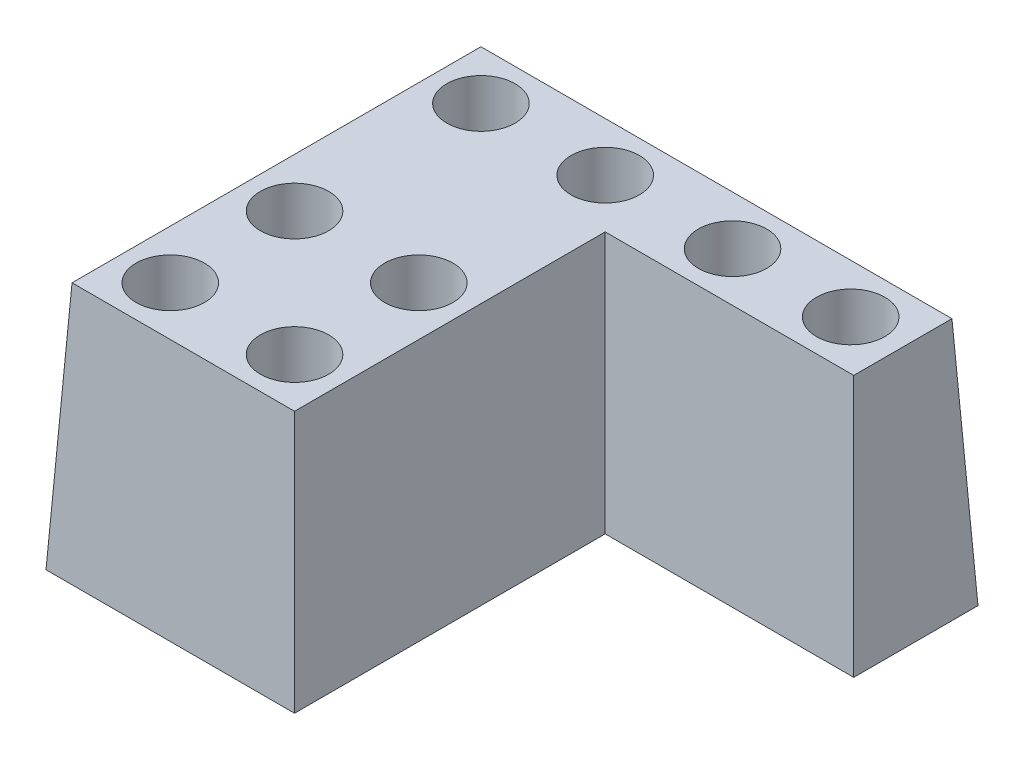
ISO-10303-21;
HEADER;
FILE_DESCRIPTION(('STEP AP214'),'2;1');
FILE_NAME('part.step','',(''),(''),'','','');
FILE_SCHEMA(('AUTOMOTIVE_DESIGN { 1 0 10303 214 1 1 1 1 }'));
ENDSEC;
DATA;
#1=APPLICATION_CONTEXT('core data for automotive mechanical design processes');
#2=APPLICATION_PROTOCOL_DEFINITION('international standard','automotive_design',2000,#1);
#3=PRODUCT_CONTEXT('',#1,'mechanical');
#4=PRODUCT('Part','Part','',(#3));
#5=PRODUCT_RELATED_PRODUCT_CATEGORY('part','',(#4));
#6=PRODUCT_DEFINITION_FORMATION('','',#4);
#7=PRODUCT_DEFINITION_CONTEXT('part definition',#1,'design');
#8=PRODUCT_DEFINITION('design','',#6,#7);
#9=PRODUCT_DEFINITION_SHAPE('','',#8);
#10=(LENGTH_UNIT() NAMED_UNIT(*) SI_UNIT(.MILLI.,.METRE.));
#11=(NAMED_UNIT(*) PLANE_ANGLE_UNIT() SI_UNIT($,.RADIAN.));
#12=(NAMED_UNIT(*) SI_UNIT($,.STERADIAN.) SOLID_ANGLE_UNIT());
#13=UNCERTAINTY_MEASURE_WITH_UNIT(LENGTH_MEASURE(1.E-05),#10,'distance_accuracy_value','');
#14=(GEOMETRIC_REPRESENTATION_CONTEXT(3) GLOBAL_UNCERTAINTY_ASSIGNED_CONTEXT((#13)) GLOBAL_UNIT_ASSIGNED_CONTEXT((#10,
#11,#12)) REPRESENTATION_CONTEXT('',''));
#15=CARTESIAN_POINT('',(0.,0.,0.));
#16=DIRECTION('',(0.,0.,1.));
#17=DIRECTION('',(1.,0.,0.));
#18=AXIS2_PLACEMENT_3D('',#15,#16,#17);
#19=CARTESIAN_POINT('',(0.,0.,0.));
#20=DIRECTION('',(-0.998629534754574,0.0523359562429439,0.));
#21=DIRECTION('',(-0.0523359562429439,-0.998629534754574,0.));
#22=AXIS2_PLACEMENT_3D('',#19,#20,#21);
#23=PLANE('',#22);
#24=DIRECTION('',(0.,0.,1.));
#25=VECTOR('',#24,1.);
#26=CARTESIAN_POINT('',(0.,0.,0.));
#27=LINE('',#26,#25);
#28=CARTESIAN_POINT('',(0.,0.,-70.));
#29=VERTEX_POINT('',#28);
#30=CARTESIAN_POINT('',(0.,0.,0.));
#31=VERTEX_POINT('',#30);
#32=EDGE_CURVE('E92',#29,#31,#27,.T.);
#33=ORIENTED_EDGE('',*,*,#32,.T.);
#34=DIRECTION('',(-0.052264427688714,-0.997264688634237,0.052264427688714));
#35=VECTOR('',#34,1.);
#36=CARTESIAN_POINT('',(0.,0.,0.));
#37=LINE('',#36,#35);
#38=CARTESIAN_POINT('',(2.09631117132165,40.,-2.09631117132165));
#39=VERTEX_POINT('',#38);
#40=EDGE_CURVE('E11',#39,#31,#37,.T.);
#41=ORIENTED_EDGE('',*,*,#40,.F.);
#42=DIRECTION('',(0.,0.,-1.));
#43=VECTOR('',#42,1.);
#44=CARTESIAN_POINT('',(2.09631117132165,40.,0.));
#45=LINE('',#44,#43);
#46=CARTESIAN_POINT('',(2.09631117132165,40.,-67.9036888286784));
#47=VERTEX_POINT('',#46);
#48=EDGE_CURVE('E118',#47,#39,#45,.F.);
#49=ORIENTED_EDGE('',*,*,#48,.F.);
#50=DIRECTION('',(-0.052264427688714,-0.997264688634237,-0.052264427688714));
#51=VECTOR('',#50,1.);
#52=CARTESIAN_POINT('',(0.191209928114017,3.64850277439424,-69.808790071886));
#53=LINE('',#52,#51);
#54=EDGE_CURVE('E104',#47,#29,#53,.T.);
#55=ORIENTED_EDGE('',*,*,#54,.T.);
#56=EDGE_LOOP('',(#33,#41,#49,#55));
#57=FACE_BOUND('',#56,.T.);
#58=ADVANCED_FACE('F34',(#57),#23,.T.);
#59=CARTESIAN_POINT('',(0.,0.,0.));
#60=DIRECTION('',(0.,0.0523359562429439,0.998629534754574));
#61=DIRECTION('',(0.,-0.998629534754574,0.0523359562429439));
#62=AXIS2_PLACEMENT_3D('',#59,#60,#61);
#63=PLANE('',#62);
#64=DIRECTION('',(1.,0.,0.));
#65=VECTOR('',#64,1.);
#66=CARTESIAN_POINT('',(0.,0.,0.));
#67=LINE('',#66,#65);
#68=CARTESIAN_POINT('',(40.,0.,0.));
#69=VERTEX_POINT('',#68);
#70=EDGE_CURVE('E88',#31,#69,#67,.T.);
#71=ORIENTED_EDGE('',*,*,#70,.T.);
#72=DIRECTION('',(0.052264427688714,-0.997264688634237,0.052264427688714));
#73=VECTOR('',#72,1.);
#74=CARTESIAN_POINT('',(40.,0.,0.));
#75=LINE('',#74,#73);
#76=CARTESIAN_POINT('',(37.9036888286784,40.,-2.09631117132165));
#77=VERTEX_POINT('',#76);
#78=EDGE_CURVE('E43',#77,#69,#75,.T.);
#79=ORIENTED_EDGE('',*,*,#78,.F.);
#80=DIRECTION('',(-1.,0.,0.));
#81=VECTOR('',#80,1.);
#82=CARTESIAN_POINT('',(0.,40.,-2.09631117132165));
#83=LINE('',#82,#81);
#84=EDGE_CURVE('E100',#39,#77,#83,.F.);
#85=ORIENTED_EDGE('',*,*,#84,.F.);
#86=ORIENTED_EDGE('',*,*,#40,.T.);
#87=EDGE_LOOP('',(#71,#79,#85,#86));
#88=FACE_BOUND('',#87,.T.);
#89=ADVANCED_FACE('F36',(#88),#63,.T.);
#90=CARTESIAN_POINT('',(40.,0.,0.));
#91=DIRECTION('',(0.998629534754574,0.0523359562429439,0.));
#92=DIRECTION('',(-0.0523359562429439,0.998629534754574,0.));
#93=AXIS2_PLACEMENT_3D('',#90,#91,#92);
#94=PLANE('',#93);
#95=DIRECTION('',(0.,0.,-1.));
#96=VECTOR('',#95,1.);
#97=CARTESIAN_POINT('',(40.,0.,0.));
#98=LINE('',#97,#96);
#99=CARTESIAN_POINT('',(40.,0.,-50.));
#100=VERTEX_POINT('',#99);
#101=EDGE_CURVE('E94',#69,#100,#98,.T.);
#102=ORIENTED_EDGE('',*,*,#101,.T.);
#103=DIRECTION('',(0.052264427688714,-0.997264688634237,0.052264427688714));
#104=VECTOR('',#103,1.);
#105=CARTESIAN_POINT('',(40.1365785200814,-2.6060734102816,-49.8634214799186));
#106=LINE('',#105,#104);
#107=CARTESIAN_POINT('',(37.9036888286784,40.,-52.0963111713216));
#108=VERTEX_POINT('',#107);
#109=EDGE_CURVE('E127',#108,#100,#106,.T.);
#110=ORIENTED_EDGE('',*,*,#109,.F.);
#111=DIRECTION('',(0.,0.,1.));
#112=VECTOR('',#111,1.);
#113=CARTESIAN_POINT('',(37.9036888286783,40.,0.));
#114=LINE('',#113,#112);
#115=EDGE_CURVE('E133',#77,#108,#114,.F.);
#116=ORIENTED_EDGE('',*,*,#115,.F.);
#117=ORIENTED_EDGE('',*,*,#78,.T.);
#118=EDGE_LOOP('',(#102,#110,#116,#117));
#119=FACE_BOUND('',#118,.T.);
#120=ADVANCED_FACE('F149',(#119),#94,.T.);
#121=CARTESIAN_POINT('',(80.,0.,-50.));
#122=DIRECTION('',(0.,0.0523359562429439,0.998629534754574));
#123=DIRECTION('',(0.,-0.998629534754574,0.0523359562429439));
#124=AXIS2_PLACEMENT_3D('',#121,#122,#123);
#125=PLANE('',#124);
#126=DIRECTION('',(1.,0.,0.));
#127=VECTOR('',#126,1.);
#128=CARTESIAN_POINT('',(80.,0.,-50.));
#129=LINE('',#128,#127);
#130=CARTESIAN_POINT('',(80.,0.,-50.));
#131=VERTEX_POINT('',#130);
#132=EDGE_CURVE('E113',#100,#131,#129,.T.);
#133=ORIENTED_EDGE('',*,*,#132,.T.);
#134=DIRECTION('',(0.052264427688714,-0.997264688634237,0.052264427688714));
#135=VECTOR('',#134,1.);
#136=CARTESIAN_POINT('',(80.,0.,-50.));
#137=LINE('',#136,#135);
#138=CARTESIAN_POINT('',(77.9036888286783,40.,-52.0963111713216));
#139=VERTEX_POINT('',#138);
#140=EDGE_CURVE('E124',#139,#131,#137,.T.);
#141=ORIENTED_EDGE('',*,*,#140,.F.);
#142=DIRECTION('',(-1.,0.,0.));
#143=VECTOR('',#142,1.);
#144=CARTESIAN_POINT('',(0.,40.,-52.0963111713216));
#145=LINE('',#144,#143);
#146=EDGE_CURVE('E135',#108,#139,#145,.F.);
#147=ORIENTED_EDGE('',*,*,#146,.F.);
#148=ORIENTED_EDGE('',*,*,#109,.T.);
#149=EDGE_LOOP('',(#133,#141,#147,#148));
#150=FACE_BOUND('',#149,.T.);
#151=ADVANCED_FACE('F142',(#150),#125,.T.);
#152=CARTESIAN_POINT('',(80.,0.,-50.));
#153=DIRECTION('',(0.998629534754574,0.0523359562429439,0.));
#154=DIRECTION('',(-0.0523359562429439,0.998629534754574,0.));
#155=AXIS2_PLACEMENT_3D('',#152,#153,#154);
#156=PLANE('',#155);
#157=DIRECTION('',(0.,0.,-1.));
#158=VECTOR('',#157,1.);
#159=CARTESIAN_POINT('',(80.,0.,-50.));
#160=LINE('',#159,#158);
#161=CARTESIAN_POINT('',(80.,0.,-70.));
#162=VERTEX_POINT('',#161);
#163=EDGE_CURVE('E115',#131,#162,#160,.T.);
#164=ORIENTED_EDGE('',*,*,#163,.T.);
#165=DIRECTION('',(0.052264427688714,-0.997264688634237,-0.052264427688714));
#166=VECTOR('',#165,1.);
#167=CARTESIAN_POINT('',(79.7814743678697,4.16971745645056,-69.7814743678697));
#168=LINE('',#167,#166);
#169=CARTESIAN_POINT('',(77.9036888286783,40.,-67.9036888286784));
#170=VERTEX_POINT('',#169);
#171=EDGE_CURVE('E121',#170,#162,#168,.T.);
#172=ORIENTED_EDGE('',*,*,#171,.F.);
#173=DIRECTION('',(0.,0.,1.));
#174=VECTOR('',#173,1.);
#175=CARTESIAN_POINT('',(77.9036888286783,40.,0.));
#176=LINE('',#175,#174);
#177=EDGE_CURVE('E55',#139,#170,#176,.F.);
#178=ORIENTED_EDGE('',*,*,#177,.F.);
#179=ORIENTED_EDGE('',*,*,#140,.T.);
#180=EDGE_LOOP('',(#164,#172,#178,#179));
#181=FACE_BOUND('',#180,.T.);
#182=ADVANCED_FACE('F145',(#181),#156,.T.);
#183=CARTESIAN_POINT('',(0.,0.,-70.));
#184=DIRECTION('',(0.,0.0523359562429439,-0.998629534754574));
#185=DIRECTION('',(0.,0.998629534754574,0.0523359562429439));
#186=AXIS2_PLACEMENT_3D('',#183,#184,#185);
#187=PLANE('',#186);
#188=DIRECTION('',(-1.,0.,0.));
#189=VECTOR('',#188,1.);
#190=CARTESIAN_POINT('',(0.,0.,-70.));
#191=LINE('',#190,#189);
#192=EDGE_CURVE('E117',#162,#29,#191,.T.);
#193=ORIENTED_EDGE('',*,*,#192,.T.);
#194=ORIENTED_EDGE('',*,*,#54,.F.);
#195=DIRECTION('',(1.,0.,0.));
#196=VECTOR('',#195,1.);
#197=CARTESIAN_POINT('',(0.,40.,-67.9036888286784));
#198=LINE('',#197,#196);
#199=EDGE_CURVE('E38',#170,#47,#198,.F.);
#200=ORIENTED_EDGE('',*,*,#199,.F.);
#201=ORIENTED_EDGE('',*,*,#171,.T.);
#202=EDGE_LOOP('',(#193,#194,#200,#201));
#203=FACE_BOUND('',#202,.T.);
#204=ADVANCED_FACE('F147',(#203),#187,.T.);
#205=CARTESIAN_POINT('',(0.,40.,0.));
#206=DIRECTION('',(0.,-1.,0.));
#207=DIRECTION('',(0.,0.,-1.));
#208=AXIS2_PLACEMENT_3D('',#205,#206,#207);
#209=PLANE('',#208);
#210=CARTESIAN_POINT('',(69.5081967213115,40.,-60.));
#211=DIRECTION('',(0.,1.,0.));
#212=DIRECTION('',(0.,0.,1.));
#213=AXIS2_PLACEMENT_3D('',#210,#211,#212);
#214=CIRCLE('',#213,5.49999999999999);
#215=CARTESIAN_POINT('',(69.5081967213115,40.,-54.5));
#216=VERTEX_POINT('',#215);
#217=EDGE_CURVE('E460',#216,#216,#214,.T.);
#218=ORIENTED_EDGE('',*,*,#217,.F.);
#219=EDGE_LOOP('',(#218));
#220=FACE_BOUND('',#219,.T.);
#221=CARTESIAN_POINT('',(30.,40.,-9.99999999999999));
#222=DIRECTION('',(0.,1.,0.));
#223=DIRECTION('',(0.,0.,1.));
#224=AXIS2_PLACEMENT_3D('',#221,#222,#223);
#225=CIRCLE('',#224,5.49999999999999);
#226=CARTESIAN_POINT('',(30.,40.,-4.5));
#227=VERTEX_POINT('',#226);
#228=EDGE_CURVE('E470',#227,#227,#225,.T.);
#229=ORIENTED_EDGE('',*,*,#228,.F.);
#230=EDGE_LOOP('',(#229));
#231=FACE_BOUND('',#230,.T.);
#232=CARTESIAN_POINT('',(10.,40.,-9.99999999999999));
#233=DIRECTION('',(0.,1.,0.));
#234=DIRECTION('',(0.,0.,1.));
#235=AXIS2_PLACEMENT_3D('',#232,#233,#234);
#236=CIRCLE('',#235,5.49999999999999);
#237=CARTESIAN_POINT('',(10.,40.,-4.5));
#238=VERTEX_POINT('',#237);
#239=EDGE_CURVE('E482',#238,#238,#236,.T.);
#240=ORIENTED_EDGE('',*,*,#239,.F.);
#241=EDGE_LOOP('',(#240));
#242=FACE_BOUND('',#241,.T.);
#243=CARTESIAN_POINT('',(10.,40.,-60.));
#244=DIRECTION('',(0.,1.,0.));
#245=DIRECTION('',(0.,0.,1.));
#246=AXIS2_PLACEMENT_3D('',#243,#244,#245);
#247=CIRCLE('',#246,5.49999999999999);
#248=CARTESIAN_POINT('',(10.,40.,-54.5));
#249=VERTEX_POINT('',#248);
#250=EDGE_CURVE('E494',#249,#249,#247,.T.);
#251=ORIENTED_EDGE('',*,*,#250,.F.);
#252=EDGE_LOOP('',(#251));
#253=FACE_BOUND('',#252,.T.);
#254=CARTESIAN_POINT('',(50.4918032786886,40.,-60.));
#255=DIRECTION('',(0.,1.,0.));
#256=DIRECTION('',(0.,0.,1.));
#257=AXIS2_PLACEMENT_3D('',#254,#255,#256);
#258=CIRCLE('',#257,5.5);
#259=CARTESIAN_POINT('',(50.4918032786886,40.,-54.5));
#260=VERTEX_POINT('',#259);
#261=EDGE_CURVE('E506',#260,#260,#258,.T.);
#262=ORIENTED_EDGE('',*,*,#261,.F.);
#263=EDGE_LOOP('',(#262));
#264=FACE_BOUND('',#263,.T.);
#265=CARTESIAN_POINT('',(30.,40.,-60.));
#266=DIRECTION('',(0.,1.,0.));
#267=DIRECTION('',(0.,0.,1.));
#268=AXIS2_PLACEMENT_3D('',#265,#266,#267);
#269=CIRCLE('',#268,5.5);
#270=CARTESIAN_POINT('',(30.,40.,-54.5));
#271=VERTEX_POINT('',#270);
#272=EDGE_CURVE('E518',#271,#271,#269,.T.);
#273=ORIENTED_EDGE('',*,*,#272,.F.);
#274=EDGE_LOOP('',(#273));
#275=FACE_BOUND('',#274,.T.);
#276=CARTESIAN_POINT('',(10.,40.,-30.));
#277=DIRECTION('',(0.,1.,0.));
#278=DIRECTION('',(0.,0.,1.));
#279=AXIS2_PLACEMENT_3D('',#276,#277,#278);
#280=CIRCLE('',#279,5.5);
#281=CARTESIAN_POINT('',(10.,40.,-24.5));
#282=VERTEX_POINT('',#281);
#283=EDGE_CURVE('E530',#282,#282,#280,.T.);
#284=ORIENTED_EDGE('',*,*,#283,.F.);
#285=EDGE_LOOP('',(#284));
#286=FACE_BOUND('',#285,.T.);
#287=CARTESIAN_POINT('',(30.,40.,-30.));
#288=DIRECTION('',(0.,1.,0.));
#289=DIRECTION('',(0.,0.,1.));
#290=AXIS2_PLACEMENT_3D('',#287,#288,#289);
#291=CIRCLE('',#290,5.5);
#292=CARTESIAN_POINT('',(30.,40.,-24.5));
#293=VERTEX_POINT('',#292);
#294=EDGE_CURVE('E542',#293,#293,#291,.T.);
#295=ORIENTED_EDGE('',*,*,#294,.F.);
#296=EDGE_LOOP('',(#295));
#297=FACE_BOUND('',#296,.T.);
#298=ORIENTED_EDGE('',*,*,#48,.T.);
#299=ORIENTED_EDGE('',*,*,#84,.T.);
#300=ORIENTED_EDGE('',*,*,#115,.T.);
#301=ORIENTED_EDGE('',*,*,#146,.T.);
#302=ORIENTED_EDGE('',*,*,#177,.T.);
#303=ORIENTED_EDGE('',*,*,#199,.T.);
#304=EDGE_LOOP('',(#298,#299,#300,#301,#302,#303));
#305=FACE_BOUND('',#304,.T.);
#306=ADVANCED_FACE('F138',(#220,#231,#242,#253,#264,#275,#286,#297,#305),#209,.F.);
#307=CARTESIAN_POINT('',(0.,0.,0.));
#308=DIRECTION('',(0.,-1.,0.));
#309=DIRECTION('',(0.,0.,-1.));
#310=AXIS2_PLACEMENT_3D('',#307,#308,#309);
#311=PLANE('',#310);
#312=CARTESIAN_POINT('',(69.5081967213115,0.,-60.));
#313=DIRECTION('',(0.,1.,0.));
#314=DIRECTION('',(0.,0.,1.));
#315=AXIS2_PLACEMENT_3D('',#312,#313,#314);
#316=CIRCLE('',#315,2.74999999999999);
#317=CARTESIAN_POINT('',(69.5081967213115,0.,-57.25));
#318=VERTEX_POINT('',#317);
#319=EDGE_CURVE('E467',#318,#318,#316,.T.);
#320=ORIENTED_EDGE('',*,*,#319,.T.);
#321=EDGE_LOOP('',(#320));
#322=FACE_BOUND('',#321,.T.);
#323=CARTESIAN_POINT('',(30.,0.,-9.99999999999999));
#324=DIRECTION('',(0.,1.,0.));
#325=DIRECTION('',(0.,0.,1.));
#326=AXIS2_PLACEMENT_3D('',#323,#324,#325);
#327=CIRCLE('',#326,2.74999999999999);
#328=CARTESIAN_POINT('',(30.,0.,-7.25));
#329=VERTEX_POINT('',#328);
#330=EDGE_CURVE('E479',#329,#329,#327,.T.);
#331=ORIENTED_EDGE('',*,*,#330,.T.);
#332=EDGE_LOOP('',(#331));
#333=FACE_BOUND('',#332,.T.);
#334=CARTESIAN_POINT('',(10.,0.,-9.99999999999999));
#335=DIRECTION('',(0.,1.,0.));
#336=DIRECTION('',(0.,0.,1.));
#337=AXIS2_PLACEMENT_3D('',#334,#335,#336);
#338=CIRCLE('',#337,2.74999999999999);
#339=CARTESIAN_POINT('',(10.,0.,-7.25));
#340=VERTEX_POINT('',#339);
#341=EDGE_CURVE('E491',#340,#340,#338,.T.);
#342=ORIENTED_EDGE('',*,*,#341,.T.);
#343=EDGE_LOOP('',(#342));
#344=FACE_BOUND('',#343,.T.);
#345=CARTESIAN_POINT('',(10.,0.,-60.));
#346=DIRECTION('',(0.,1.,0.));
#347=DIRECTION('',(0.,0.,1.));
#348=AXIS2_PLACEMENT_3D('',#345,#346,#347);
#349=CIRCLE('',#348,2.74999999999999);
#350=CARTESIAN_POINT('',(10.,0.,-57.25));
#351=VERTEX_POINT('',#350);
#352=EDGE_CURVE('E503',#351,#351,#349,.T.);
#353=ORIENTED_EDGE('',*,*,#352,.T.);
#354=EDGE_LOOP('',(#353));
#355=FACE_BOUND('',#354,.T.);
#356=CARTESIAN_POINT('',(50.4918032786886,0.,-60.));
#357=DIRECTION('',(0.,1.,0.));
#358=DIRECTION('',(0.,0.,1.));
#359=AXIS2_PLACEMENT_3D('',#356,#357,#358);
#360=CIRCLE('',#359,2.74999999999999);
#361=CARTESIAN_POINT('',(50.4918032786886,0.,-57.25));
#362=VERTEX_POINT('',#361);
#363=EDGE_CURVE('E515',#362,#362,#360,.T.);
#364=ORIENTED_EDGE('',*,*,#363,.T.);
#365=EDGE_LOOP('',(#364));
#366=FACE_BOUND('',#365,.T.);
#367=CARTESIAN_POINT('',(30.,0.,-60.));
#368=DIRECTION('',(0.,1.,0.));
#369=DIRECTION('',(0.,0.,1.));
#370=AXIS2_PLACEMENT_3D('',#367,#368,#369);
#371=CIRCLE('',#370,2.74999999999999);
#372=CARTESIAN_POINT('',(30.,0.,-57.25));
#373=VERTEX_POINT('',#372);
#374=EDGE_CURVE('E527',#373,#373,#371,.T.);
#375=ORIENTED_EDGE('',*,*,#374,.T.);
#376=EDGE_LOOP('',(#375));
#377=FACE_BOUND('',#376,.T.);
#378=CARTESIAN_POINT('',(10.,0.,-30.));
#379=DIRECTION('',(0.,1.,0.));
#380=DIRECTION('',(0.,0.,1.));
#381=AXIS2_PLACEMENT_3D('',#378,#379,#380);
#382=CIRCLE('',#381,2.74999999999999);
#383=CARTESIAN_POINT('',(10.,0.,-27.25));
#384=VERTEX_POINT('',#383);
#385=EDGE_CURVE('E539',#384,#384,#382,.T.);
#386=ORIENTED_EDGE('',*,*,#385,.T.);
#387=EDGE_LOOP('',(#386));
#388=FACE_BOUND('',#387,.T.);
#389=CARTESIAN_POINT('',(30.,0.,-30.));
#390=DIRECTION('',(0.,1.,0.));
#391=DIRECTION('',(0.,0.,1.));
#392=AXIS2_PLACEMENT_3D('',#389,#390,#391);
#393=CIRCLE('',#392,2.74999999999999);
#394=CARTESIAN_POINT('',(30.,0.,-27.25));
#395=VERTEX_POINT('',#394);
#396=EDGE_CURVE('E105',#395,#395,#393,.T.);
#397=ORIENTED_EDGE('',*,*,#396,.T.);
#398=EDGE_LOOP('',(#397));
#399=FACE_BOUND('',#398,.T.);
#400=ORIENTED_EDGE('',*,*,#32,.F.);
#401=ORIENTED_EDGE('',*,*,#192,.F.);
#402=ORIENTED_EDGE('',*,*,#163,.F.);
#403=ORIENTED_EDGE('',*,*,#132,.F.);
#404=ORIENTED_EDGE('',*,*,#101,.F.);
#405=ORIENTED_EDGE('',*,*,#70,.F.);
#406=EDGE_LOOP('',(#400,#401,#402,#403,#404,#405));
#407=FACE_BOUND('',#406,.T.);
#408=ADVANCED_FACE('F89',(#322,#333,#344,#355,#366,#377,#388,#399,#407),#311,.T.);
#409=CARTESIAN_POINT('',(30.,40.,-30.));
#410=DIRECTION('',(0.,1.,0.));
#411=DIRECTION('',(0.,0.,1.));
#412=AXIS2_PLACEMENT_3D('',#409,#410,#411);
#413=CYLINDRICAL_SURFACE('',#412,2.74999999999999);
#414=ORIENTED_EDGE('',*,*,#396,.F.);
#415=EDGE_LOOP('',(#414));
#416=FACE_BOUND('',#415,.T.);
#417=CARTESIAN_POINT('',(30.,5.,-30.));
#418=DIRECTION('',(0.,1.,0.));
#419=DIRECTION('',(0.,0.,1.));
#420=AXIS2_PLACEMENT_3D('',#417,#418,#419);
#421=CIRCLE('',#420,2.75);
#422=CARTESIAN_POINT('',(30.,5.,-27.25));
#423=VERTEX_POINT('',#422);
#424=EDGE_CURVE('E108',#423,#423,#421,.T.);
#425=ORIENTED_EDGE('',*,*,#424,.T.);
#426=EDGE_LOOP('',(#425));
#427=FACE_BOUND('',#426,.T.);
#428=ADVANCED_FACE('F186',(#416,#427),#413,.F.);
#429=CARTESIAN_POINT('',(32.75,5.,-30.));
#430=DIRECTION('',(0.,-1.,0.));
#431=DIRECTION('',(0.,0.,-1.));
#432=AXIS2_PLACEMENT_3D('',#429,#430,#431);
#433=PLANE('',#432);
#434=ORIENTED_EDGE('',*,*,#424,.F.);
#435=EDGE_LOOP('',(#434));
#436=FACE_BOUND('',#435,.T.);
#437=CARTESIAN_POINT('',(30.,5.,-30.));
#438=DIRECTION('',(0.,1.,0.));
#439=DIRECTION('',(0.,0.,1.));
#440=AXIS2_PLACEMENT_3D('',#437,#438,#439);
#441=CIRCLE('',#440,5.49999999999999);
#442=CARTESIAN_POINT('',(30.,5.,-24.5));
#443=VERTEX_POINT('',#442);
#444=EDGE_CURVE('E545',#443,#443,#441,.T.);
#445=ORIENTED_EDGE('',*,*,#444,.T.);
#446=EDGE_LOOP('',(#445));
#447=FACE_BOUND('',#446,.T.);
#448=ADVANCED_FACE('F193',(#436,#447),#433,.F.);
#449=CARTESIAN_POINT('',(30.,40.,-30.));
#450=DIRECTION('',(0.,1.,0.));
#451=DIRECTION('',(0.,0.,1.));
#452=AXIS2_PLACEMENT_3D('',#449,#450,#451);
#453=CYLINDRICAL_SURFACE('',#452,5.49999999999999);
#454=ORIENTED_EDGE('',*,*,#444,.F.);
#455=EDGE_LOOP('',(#454));
#456=FACE_BOUND('',#455,.T.);
#457=ORIENTED_EDGE('',*,*,#294,.T.);
#458=EDGE_LOOP('',(#457));
#459=FACE_BOUND('',#458,.T.);
#460=ADVANCED_FACE('F201',(#456,#459),#453,.F.);
#461=CARTESIAN_POINT('',(10.,40.,-30.));
#462=DIRECTION('',(0.,1.,0.));
#463=DIRECTION('',(0.,0.,1.));
#464=AXIS2_PLACEMENT_3D('',#461,#462,#463);
#465=CYLINDRICAL_SURFACE('',#464,2.74999999999999);
#466=ORIENTED_EDGE('',*,*,#385,.F.);
#467=EDGE_LOOP('',(#466));
#468=FACE_BOUND('',#467,.T.);
#469=CARTESIAN_POINT('',(10.,5.,-30.));
#470=DIRECTION('',(0.,1.,0.));
#471=DIRECTION('',(0.,0.,1.));
#472=AXIS2_PLACEMENT_3D('',#469,#470,#471);
#473=CIRCLE('',#472,2.75);
#474=CARTESIAN_POINT('',(10.,5.,-27.25));
#475=VERTEX_POINT('',#474);
#476=EDGE_CURVE('E536',#475,#475,#473,.T.);
#477=ORIENTED_EDGE('',*,*,#476,.T.);
#478=EDGE_LOOP('',(#477));
#479=FACE_BOUND('',#478,.T.);
#480=ADVANCED_FACE('F209',(#468,#479),#465,.F.);
#481=CARTESIAN_POINT('',(12.75,5.,-30.));
#482=DIRECTION('',(0.,-1.,0.));
#483=DIRECTION('',(0.,0.,-1.));
#484=AXIS2_PLACEMENT_3D('',#481,#482,#483);
#485=PLANE('',#484);
#486=ORIENTED_EDGE('',*,*,#476,.F.);
#487=EDGE_LOOP('',(#486));
#488=FACE_BOUND('',#487,.T.);
#489=CARTESIAN_POINT('',(10.,5.,-30.));
#490=DIRECTION('',(0.,1.,0.));
#491=DIRECTION('',(0.,0.,1.));
#492=AXIS2_PLACEMENT_3D('',#489,#490,#491);
#493=CIRCLE('',#492,5.49999999999999);
#494=CARTESIAN_POINT('',(10.,5.,-24.5));
#495=VERTEX_POINT('',#494);
#496=EDGE_CURVE('E533',#495,#495,#493,.T.);
#497=ORIENTED_EDGE('',*,*,#496,.T.);
#498=EDGE_LOOP('',(#497));
#499=FACE_BOUND('',#498,.T.);
#500=ADVANCED_FACE('F217',(#488,#499),#485,.F.);
#501=CARTESIAN_POINT('',(10.,40.,-30.));
#502=DIRECTION('',(0.,1.,0.));
#503=DIRECTION('',(0.,0.,1.));
#504=AXIS2_PLACEMENT_3D('',#501,#502,#503);
#505=CYLINDRICAL_SURFACE('',#504,5.49999999999999);
#506=ORIENTED_EDGE('',*,*,#496,.F.);
#507=EDGE_LOOP('',(#506));
#508=FACE_BOUND('',#507,.T.);
#509=ORIENTED_EDGE('',*,*,#283,.T.);
#510=EDGE_LOOP('',(#509));
#511=FACE_BOUND('',#510,.T.);
#512=ADVANCED_FACE('F225',(#508,#511),#505,.F.);
#513=CARTESIAN_POINT('',(30.,40.,-60.));
#514=DIRECTION('',(0.,1.,0.));
#515=DIRECTION('',(0.,0.,1.));
#516=AXIS2_PLACEMENT_3D('',#513,#514,#515);
#517=CYLINDRICAL_SURFACE('',#516,2.75);
#518=ORIENTED_EDGE('',*,*,#374,.F.);
#519=EDGE_LOOP('',(#518));
#520=FACE_BOUND('',#519,.T.);
#521=CARTESIAN_POINT('',(30.,5.,-60.));
#522=DIRECTION('',(0.,1.,0.));
#523=DIRECTION('',(0.,0.,1.));
#524=AXIS2_PLACEMENT_3D('',#521,#522,#523);
#525=CIRCLE('',#524,2.75);
#526=CARTESIAN_POINT('',(30.,5.,-57.25));
#527=VERTEX_POINT('',#526);
#528=EDGE_CURVE('E524',#527,#527,#525,.T.);
#529=ORIENTED_EDGE('',*,*,#528,.T.);
#530=EDGE_LOOP('',(#529));
#531=FACE_BOUND('',#530,.T.);
#532=ADVANCED_FACE('F233',(#520,#531),#517,.F.);
#533=CARTESIAN_POINT('',(32.75,5.,-60.));
#534=DIRECTION('',(0.,-1.,0.));
#535=DIRECTION('',(0.,0.,-1.));
#536=AXIS2_PLACEMENT_3D('',#533,#534,#535);
#537=PLANE('',#536);
#538=ORIENTED_EDGE('',*,*,#528,.F.);
#539=EDGE_LOOP('',(#538));
#540=FACE_BOUND('',#539,.T.);
#541=CARTESIAN_POINT('',(30.,5.,-60.));
#542=DIRECTION('',(0.,1.,0.));
#543=DIRECTION('',(0.,0.,1.));
#544=AXIS2_PLACEMENT_3D('',#541,#542,#543);
#545=CIRCLE('',#544,5.49999999999999);
#546=CARTESIAN_POINT('',(30.,5.,-54.5));
#547=VERTEX_POINT('',#546);
#548=EDGE_CURVE('E521',#547,#547,#545,.T.);
#549=ORIENTED_EDGE('',*,*,#548,.T.);
#550=EDGE_LOOP('',(#549));
#551=FACE_BOUND('',#550,.T.);
#552=ADVANCED_FACE('F241',(#540,#551),#537,.F.);
#553=CARTESIAN_POINT('',(30.,40.,-60.));
#554=DIRECTION('',(0.,1.,0.));
#555=DIRECTION('',(0.,0.,1.));
#556=AXIS2_PLACEMENT_3D('',#553,#554,#555);
#557=CYLINDRICAL_SURFACE('',#556,5.49999999999999);
#558=ORIENTED_EDGE('',*,*,#548,.F.);
#559=EDGE_LOOP('',(#558));
#560=FACE_BOUND('',#559,.T.);
#561=ORIENTED_EDGE('',*,*,#272,.T.);
#562=EDGE_LOOP('',(#561));
#563=FACE_BOUND('',#562,.T.);
#564=ADVANCED_FACE('F249',(#560,#563),#557,.F.);
#565=CARTESIAN_POINT('',(50.4918032786886,40.,-60.));
#566=DIRECTION('',(0.,1.,0.));
#567=DIRECTION('',(0.,0.,1.));
#568=AXIS2_PLACEMENT_3D('',#565,#566,#567);
#569=CYLINDRICAL_SURFACE('',#568,2.75);
#570=ORIENTED_EDGE('',*,*,#363,.F.);
#571=EDGE_LOOP('',(#570));
#572=FACE_BOUND('',#571,.T.);
#573=CARTESIAN_POINT('',(50.4918032786886,5.,-60.));
#574=DIRECTION('',(0.,1.,0.));
#575=DIRECTION('',(0.,0.,1.));
#576=AXIS2_PLACEMENT_3D('',#573,#574,#575);
#577=CIRCLE('',#576,2.75);
#578=CARTESIAN_POINT('',(50.4918032786886,5.,-57.25));
#579=VERTEX_POINT('',#578);
#580=EDGE_CURVE('E512',#579,#579,#577,.T.);
#581=ORIENTED_EDGE('',*,*,#580,.T.);
#582=EDGE_LOOP('',(#581));
#583=FACE_BOUND('',#582,.T.);
#584=ADVANCED_FACE('F257',(#572,#583),#569,.F.);
#585=CARTESIAN_POINT('',(53.2418032786886,5.,-60.));
#586=DIRECTION('',(0.,-1.,0.));
#587=DIRECTION('',(0.,0.,-1.));
#588=AXIS2_PLACEMENT_3D('',#585,#586,#587);
#589=PLANE('',#588);
#590=ORIENTED_EDGE('',*,*,#580,.F.);
#591=EDGE_LOOP('',(#590));
#592=FACE_BOUND('',#591,.T.);
#593=CARTESIAN_POINT('',(50.4918032786886,5.,-60.));
#594=DIRECTION('',(0.,1.,0.));
#595=DIRECTION('',(0.,0.,1.));
#596=AXIS2_PLACEMENT_3D('',#593,#594,#595);
#597=CIRCLE('',#596,5.49999999999999);
#598=CARTESIAN_POINT('',(50.4918032786886,5.,-54.5));
#599=VERTEX_POINT('',#598);
#600=EDGE_CURVE('E509',#599,#599,#597,.T.);
#601=ORIENTED_EDGE('',*,*,#600,.T.);
#602=EDGE_LOOP('',(#601));
#603=FACE_BOUND('',#602,.T.);
#604=ADVANCED_FACE('F265',(#592,#603),#589,.F.);
#605=CARTESIAN_POINT('',(50.4918032786886,40.,-60.));
#606=DIRECTION('',(0.,1.,0.));
#607=DIRECTION('',(0.,0.,1.));
#608=AXIS2_PLACEMENT_3D('',#605,#606,#607);
#609=CYLINDRICAL_SURFACE('',#608,5.49999999999999);
#610=ORIENTED_EDGE('',*,*,#600,.F.);
#611=EDGE_LOOP('',(#610));
#612=FACE_BOUND('',#611,.T.);
#613=ORIENTED_EDGE('',*,*,#261,.T.);
#614=EDGE_LOOP('',(#613));
#615=FACE_BOUND('',#614,.T.);
#616=ADVANCED_FACE('F273',(#612,#615),#609,.F.);
#617=CARTESIAN_POINT('',(10.,40.,-60.));
#618=DIRECTION('',(0.,1.,0.));
#619=DIRECTION('',(0.,0.,1.));
#620=AXIS2_PLACEMENT_3D('',#617,#618,#619);
#621=CYLINDRICAL_SURFACE('',#620,2.74999999999999);
#622=ORIENTED_EDGE('',*,*,#352,.F.);
#623=EDGE_LOOP('',(#622));
#624=FACE_BOUND('',#623,.T.);
#625=CARTESIAN_POINT('',(10.,5.,-60.));
#626=DIRECTION('',(0.,1.,0.));
#627=DIRECTION('',(0.,0.,1.));
#628=AXIS2_PLACEMENT_3D('',#625,#626,#627);
#629=CIRCLE('',#628,2.75);
#630=CARTESIAN_POINT('',(10.,5.,-57.25));
#631=VERTEX_POINT('',#630);
#632=EDGE_CURVE('E500',#631,#631,#629,.T.);
#633=ORIENTED_EDGE('',*,*,#632,.T.);
#634=EDGE_LOOP('',(#633));
#635=FACE_BOUND('',#634,.T.);
#636=ADVANCED_FACE('F281',(#624,#635),#621,.F.);
#637=CARTESIAN_POINT('',(12.75,5.,-60.));
#638=DIRECTION('',(0.,-1.,0.));
#639=DIRECTION('',(0.,0.,-1.));
#640=AXIS2_PLACEMENT_3D('',#637,#638,#639);
#641=PLANE('',#640);
#642=ORIENTED_EDGE('',*,*,#632,.F.);
#643=EDGE_LOOP('',(#642));
#644=FACE_BOUND('',#643,.T.);
#645=CARTESIAN_POINT('',(10.,5.,-60.));
#646=DIRECTION('',(0.,1.,0.));
#647=DIRECTION('',(0.,0.,1.));
#648=AXIS2_PLACEMENT_3D('',#645,#646,#647);
#649=CIRCLE('',#648,5.49999999999999);
#650=CARTESIAN_POINT('',(10.,5.,-54.5));
#651=VERTEX_POINT('',#650);
#652=EDGE_CURVE('E497',#651,#651,#649,.T.);
#653=ORIENTED_EDGE('',*,*,#652,.T.);
#654=EDGE_LOOP('',(#653));
#655=FACE_BOUND('',#654,.T.);
#656=ADVANCED_FACE('F289',(#644,#655),#641,.F.);
#657=CARTESIAN_POINT('',(10.,40.,-60.));
#658=DIRECTION('',(0.,1.,0.));
#659=DIRECTION('',(0.,0.,1.));
#660=AXIS2_PLACEMENT_3D('',#657,#658,#659);
#661=CYLINDRICAL_SURFACE('',#660,5.49999999999999);
#662=ORIENTED_EDGE('',*,*,#652,.F.);
#663=EDGE_LOOP('',(#662));
#664=FACE_BOUND('',#663,.T.);
#665=ORIENTED_EDGE('',*,*,#250,.T.);
#666=EDGE_LOOP('',(#665));
#667=FACE_BOUND('',#666,.T.);
#668=ADVANCED_FACE('F297',(#664,#667),#661,.F.);
#669=CARTESIAN_POINT('',(10.,40.,-9.99999999999999));
#670=DIRECTION('',(0.,1.,0.));
#671=DIRECTION('',(0.,0.,1.));
#672=AXIS2_PLACEMENT_3D('',#669,#670,#671);
#673=CYLINDRICAL_SURFACE('',#672,2.74999999999999);
#674=ORIENTED_EDGE('',*,*,#341,.F.);
#675=EDGE_LOOP('',(#674));
#676=FACE_BOUND('',#675,.T.);
#677=CARTESIAN_POINT('',(10.,5.,-9.99999999999999));
#678=DIRECTION('',(0.,1.,0.));
#679=DIRECTION('',(0.,0.,1.));
#680=AXIS2_PLACEMENT_3D('',#677,#678,#679);
#681=CIRCLE('',#680,2.75);
#682=CARTESIAN_POINT('',(10.,5.,-7.25));
#683=VERTEX_POINT('',#682);
#684=EDGE_CURVE('E488',#683,#683,#681,.T.);
#685=ORIENTED_EDGE('',*,*,#684,.T.);
#686=EDGE_LOOP('',(#685));
#687=FACE_BOUND('',#686,.T.);
#688=ADVANCED_FACE('F305',(#676,#687),#673,.F.);
#689=CARTESIAN_POINT('',(12.75,5.,-9.99999999999999));
#690=DIRECTION('',(0.,-1.,0.));
#691=DIRECTION('',(0.,0.,-1.));
#692=AXIS2_PLACEMENT_3D('',#689,#690,#691);
#693=PLANE('',#692);
#694=ORIENTED_EDGE('',*,*,#684,.F.);
#695=EDGE_LOOP('',(#694));
#696=FACE_BOUND('',#695,.T.);
#697=CARTESIAN_POINT('',(10.,5.,-9.99999999999999));
#698=DIRECTION('',(0.,1.,0.));
#699=DIRECTION('',(0.,0.,1.));
#700=AXIS2_PLACEMENT_3D('',#697,#698,#699);
#701=CIRCLE('',#700,5.49999999999999);
#702=CARTESIAN_POINT('',(10.,5.,-4.5));
#703=VERTEX_POINT('',#702);
#704=EDGE_CURVE('E485',#703,#703,#701,.T.);
#705=ORIENTED_EDGE('',*,*,#704,.T.);
#706=EDGE_LOOP('',(#705));
#707=FACE_BOUND('',#706,.T.);
#708=ADVANCED_FACE('F313',(#696,#707),#693,.F.);
#709=CARTESIAN_POINT('',(10.,40.,-9.99999999999999));
#710=DIRECTION('',(0.,1.,0.));
#711=DIRECTION('',(0.,0.,1.));
#712=AXIS2_PLACEMENT_3D('',#709,#710,#711);
#713=CYLINDRICAL_SURFACE('',#712,5.49999999999999);
#714=ORIENTED_EDGE('',*,*,#704,.F.);
#715=EDGE_LOOP('',(#714));
#716=FACE_BOUND('',#715,.T.);
#717=ORIENTED_EDGE('',*,*,#239,.T.);
#718=EDGE_LOOP('',(#717));
#719=FACE_BOUND('',#718,.T.);
#720=ADVANCED_FACE('F321',(#716,#719),#713,.F.);
#721=CARTESIAN_POINT('',(30.,40.,-9.99999999999999));
#722=DIRECTION('',(0.,1.,0.));
#723=DIRECTION('',(0.,0.,1.));
#724=AXIS2_PLACEMENT_3D('',#721,#722,#723);
#725=CYLINDRICAL_SURFACE('',#724,2.75);
#726=ORIENTED_EDGE('',*,*,#330,.F.);
#727=EDGE_LOOP('',(#726));
#728=FACE_BOUND('',#727,.T.);
#729=CARTESIAN_POINT('',(30.,5.,-9.99999999999999));
#730=DIRECTION('',(0.,1.,0.));
#731=DIRECTION('',(0.,0.,1.));
#732=AXIS2_PLACEMENT_3D('',#729,#730,#731);
#733=CIRCLE('',#732,2.75);
#734=CARTESIAN_POINT('',(30.,5.,-7.25));
#735=VERTEX_POINT('',#734);
#736=EDGE_CURVE('E476',#735,#735,#733,.T.);
#737=ORIENTED_EDGE('',*,*,#736,.T.);
#738=EDGE_LOOP('',(#737));
#739=FACE_BOUND('',#738,.T.);
#740=ADVANCED_FACE('F329',(#728,#739),#725,.F.);
#741=CARTESIAN_POINT('',(32.75,5.,-9.99999999999999));
#742=DIRECTION('',(0.,-1.,0.));
#743=DIRECTION('',(0.,0.,-1.));
#744=AXIS2_PLACEMENT_3D('',#741,#742,#743);
#745=PLANE('',#744);
#746=ORIENTED_EDGE('',*,*,#736,.F.);
#747=EDGE_LOOP('',(#746));
#748=FACE_BOUND('',#747,.T.);
#749=CARTESIAN_POINT('',(30.,5.,-9.99999999999999));
#750=DIRECTION('',(0.,1.,0.));
#751=DIRECTION('',(0.,0.,1.));
#752=AXIS2_PLACEMENT_3D('',#749,#750,#751);
#753=CIRCLE('',#752,5.49999999999999);
#754=CARTESIAN_POINT('',(30.,5.,-4.5));
#755=VERTEX_POINT('',#754);
#756=EDGE_CURVE('E473',#755,#755,#753,.T.);
#757=ORIENTED_EDGE('',*,*,#756,.T.);
#758=EDGE_LOOP('',(#757));
#759=FACE_BOUND('',#758,.T.);
#760=ADVANCED_FACE('F337',(#748,#759),#745,.F.);
#761=CARTESIAN_POINT('',(30.,40.,-9.99999999999999));
#762=DIRECTION('',(0.,1.,0.));
#763=DIRECTION('',(0.,0.,1.));
#764=AXIS2_PLACEMENT_3D('',#761,#762,#763);
#765=CYLINDRICAL_SURFACE('',#764,5.49999999999999);
#766=ORIENTED_EDGE('',*,*,#756,.F.);
#767=EDGE_LOOP('',(#766));
#768=FACE_BOUND('',#767,.T.);
#769=ORIENTED_EDGE('',*,*,#228,.T.);
#770=EDGE_LOOP('',(#769));
#771=FACE_BOUND('',#770,.T.);
#772=ADVANCED_FACE('F345',(#768,#771),#765,.F.);
#773=CARTESIAN_POINT('',(69.5081967213115,40.,-60.));
#774=DIRECTION('',(0.,1.,0.));
#775=DIRECTION('',(0.,0.,1.));
#776=AXIS2_PLACEMENT_3D('',#773,#774,#775);
#777=CYLINDRICAL_SURFACE('',#776,2.75);
#778=ORIENTED_EDGE('',*,*,#319,.F.);
#779=EDGE_LOOP('',(#778));
#780=FACE_BOUND('',#779,.T.);
#781=CARTESIAN_POINT('',(69.5081967213115,5.,-60.));
#782=DIRECTION('',(0.,1.,0.));
#783=DIRECTION('',(0.,0.,1.));
#784=AXIS2_PLACEMENT_3D('',#781,#782,#783);
#785=CIRCLE('',#784,2.75);
#786=CARTESIAN_POINT('',(69.5081967213115,5.,-57.25));
#787=VERTEX_POINT('',#786);
#788=EDGE_CURVE('E462',#787,#787,#785,.T.);
#789=ORIENTED_EDGE('',*,*,#788,.T.);
#790=EDGE_LOOP('',(#789));
#791=FACE_BOUND('',#790,.T.);
#792=ADVANCED_FACE('F353',(#780,#791),#777,.F.);
#793=CARTESIAN_POINT('',(72.2581967213115,5.,-60.));
#794=DIRECTION('',(0.,-1.,0.));
#795=DIRECTION('',(0.,0.,-1.));
#796=AXIS2_PLACEMENT_3D('',#793,#794,#795);
#797=PLANE('',#796);
#798=ORIENTED_EDGE('',*,*,#788,.F.);
#799=EDGE_LOOP('',(#798));
#800=FACE_BOUND('',#799,.T.);
#801=CARTESIAN_POINT('',(69.5081967213115,5.,-60.));
#802=DIRECTION('',(0.,1.,0.));
#803=DIRECTION('',(0.,0.,1.));
#804=AXIS2_PLACEMENT_3D('',#801,#802,#803);
#805=CIRCLE('',#804,5.49999999999999);
#806=CARTESIAN_POINT('',(69.5081967213115,5.,-54.5));
#807=VERTEX_POINT('',#806);
#808=EDGE_CURVE('E457',#807,#807,#805,.T.);
#809=ORIENTED_EDGE('',*,*,#808,.T.);
#810=EDGE_LOOP('',(#809));
#811=FACE_BOUND('',#810,.T.);
#812=ADVANCED_FACE('F361',(#800,#811),#797,.F.);
#813=CARTESIAN_POINT('',(69.5081967213115,40.,-60.));
#814=DIRECTION('',(0.,1.,0.));
#815=DIRECTION('',(0.,0.,1.));
#816=AXIS2_PLACEMENT_3D('',#813,#814,#815);
#817=CYLINDRICAL_SURFACE('',#816,5.49999999999999);
#818=ORIENTED_EDGE('',*,*,#808,.F.);
#819=EDGE_LOOP('',(#818));
#820=FACE_BOUND('',#819,.T.);
#821=ORIENTED_EDGE('',*,*,#217,.T.);
#822=EDGE_LOOP('',(#821));
#823=FACE_BOUND('',#822,.T.);
#824=ADVANCED_FACE('F369',(#820,#823),#817,.F.);
#825=CLOSED_SHELL('',(#58,#89,#120,#151,#182,#204,#306,#408,#428,#448,#460,#480,#500,#512,#532,
#552,#564,#584,#604,#616,#636,#656,#668,#688,#708,#720,#740,#760,#772,#792,#812,#824));
#826=MANIFOLD_SOLID_BREP('B2',#825);
#827=ADVANCED_BREP_SHAPE_REPRESENTATION('',(#18,#826),#14);
#828=SHAPE_DEFINITION_REPRESENTATION(#9,#827);
ENDSEC;
END-ISO-10303-21;
